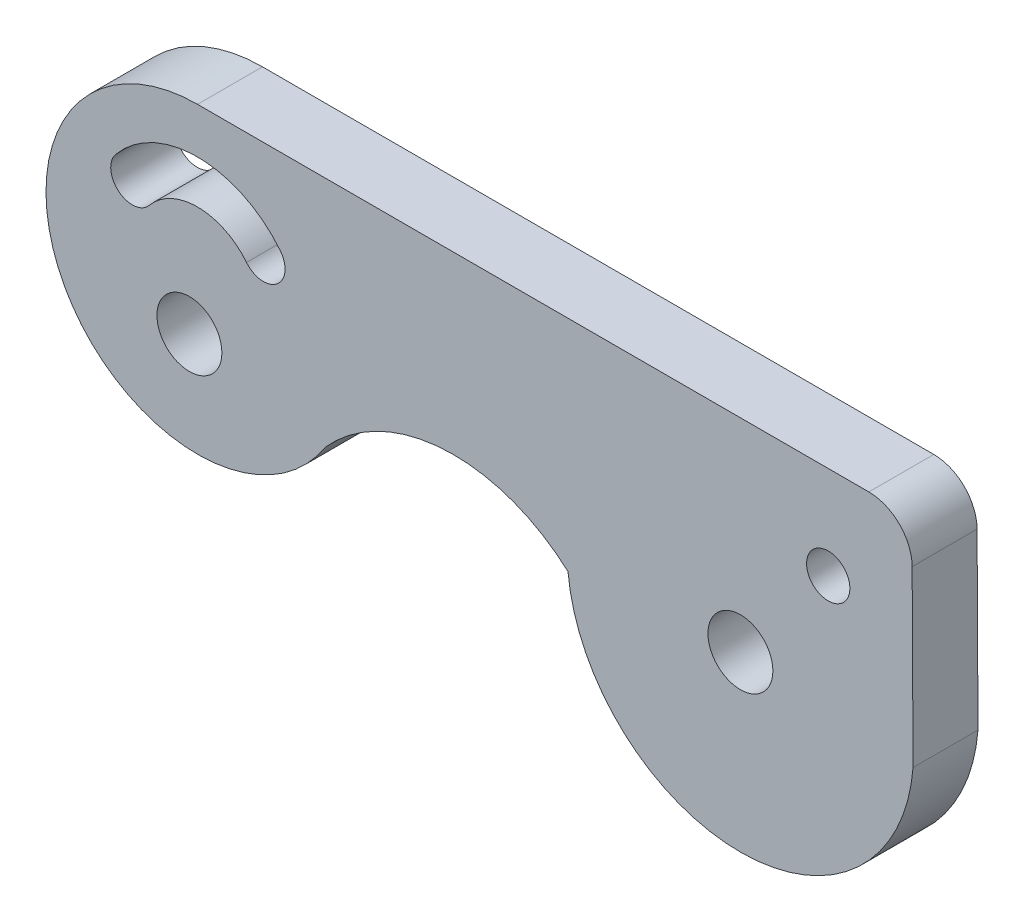
ISO-10303-21;
HEADER;
FILE_DESCRIPTION(('STEP AP214'),'2;1');
FILE_NAME('part.step','',(''),(''),'','','');
FILE_SCHEMA(('AUTOMOTIVE_DESIGN { 1 0 10303 214 1 1 1 1 }'));
ENDSEC;
DATA;
#1=APPLICATION_CONTEXT('core data for automotive mechanical design processes');
#2=APPLICATION_PROTOCOL_DEFINITION('international standard','automotive_design',2000,#1);
#3=PRODUCT_CONTEXT('',#1,'mechanical');
#4=PRODUCT('Part','Part','',(#3));
#5=PRODUCT_RELATED_PRODUCT_CATEGORY('part','',(#4));
#6=PRODUCT_DEFINITION_FORMATION('','',#4);
#7=PRODUCT_DEFINITION_CONTEXT('part definition',#1,'design');
#8=PRODUCT_DEFINITION('design','',#6,#7);
#9=PRODUCT_DEFINITION_SHAPE('','',#8);
#10=(LENGTH_UNIT() NAMED_UNIT(*) SI_UNIT(.MILLI.,.METRE.));
#11=(NAMED_UNIT(*) PLANE_ANGLE_UNIT() SI_UNIT($,.RADIAN.));
#12=(NAMED_UNIT(*) SI_UNIT($,.STERADIAN.) SOLID_ANGLE_UNIT());
#13=UNCERTAINTY_MEASURE_WITH_UNIT(LENGTH_MEASURE(1.E-05),#10,'distance_accuracy_value','');
#14=(GEOMETRIC_REPRESENTATION_CONTEXT(3) GLOBAL_UNCERTAINTY_ASSIGNED_CONTEXT((#13)) GLOBAL_UNIT_ASSIGNED_CONTEXT((#10,
#11,#12)) REPRESENTATION_CONTEXT('',''));
#15=CARTESIAN_POINT('',(0.,0.,0.));
#16=DIRECTION('',(0.,0.,1.));
#17=DIRECTION('',(1.,0.,0.));
#18=AXIS2_PLACEMENT_3D('',#15,#16,#17);
#19=CARTESIAN_POINT('',(0.,-7.,3.));
#20=DIRECTION('',(0.,0.,1.));
#21=DIRECTION('',(1.,0.,0.));
#22=AXIS2_PLACEMENT_3D('',#19,#20,#21);
#23=PLANE('',#22);
#24=CARTESIAN_POINT('',(29.1341202199942,-4.29894502293296,3.));
#25=DIRECTION('',(0.,0.,1.));
#26=DIRECTION('',(1.,0.,0.));
#27=AXIS2_PLACEMENT_3D('',#24,#25,#26);
#28=CIRCLE('',#27,1.);
#29=CARTESIAN_POINT('',(30.1341202199942,-4.29894502293296,3.));
#30=VERTEX_POINT('',#29);
#31=EDGE_CURVE('E142',#30,#30,#28,.T.);
#32=ORIENTED_EDGE('',*,*,#31,.F.);
#33=EDGE_LOOP('',(#32));
#34=FACE_BOUND('',#33,.T.);
#35=CARTESIAN_POINT('',(0.,-7.,3.));
#36=DIRECTION('',(0.,0.,1.));
#37=DIRECTION('',(1.,0.,0.));
#38=AXIS2_PLACEMENT_3D('',#35,#36,#37);
#39=CIRCLE('',#38,7.);
#40=CARTESIAN_POINT('',(0.,0.,3.));
#41=VERTEX_POINT('',#40);
#42=CARTESIAN_POINT('',(5.89507462855434,-10.7746649021834,3.));
#43=VERTEX_POINT('',#42);
#44=EDGE_CURVE('E158',#41,#43,#39,.T.);
#45=ORIENTED_EDGE('',*,*,#44,.T.);
#46=CARTESIAN_POINT('',(11.8200955665364,-16.,3.));
#47=DIRECTION('',(0.,0.,-1.));
#48=DIRECTION('',(-1.,0.,0.));
#49=AXIS2_PLACEMENT_3D('',#46,#47,#48);
#50=CIRCLE('',#49,7.9);
#51=CARTESIAN_POINT('',(17.1131167236741,-10.1353664197929,3.));
#52=VERTEX_POINT('',#51);
#53=EDGE_CURVE('E161',#43,#52,#50,.T.);
#54=ORIENTED_EDGE('',*,*,#53,.T.);
#55=CARTESIAN_POINT('',(25.0771298747732,-9.37741224629706,3.));
#56=DIRECTION('',(0.,0.,1.));
#57=DIRECTION('',(1.,0.,0.));
#58=AXIS2_PLACEMENT_3D('',#55,#56,#57);
#59=CIRCLE('',#58,8.);
#60=CARTESIAN_POINT('',(33.0525715786033,-10.0037744648319,3.));
#61=VERTEX_POINT('',#60);
#62=EDGE_CURVE('E164',#52,#61,#59,.T.);
#63=ORIENTED_EDGE('',*,*,#62,.T.);
#64=DIRECTION('',(-0.00525510174907032,0.999986191857471,0.));
#65=VECTOR('',#64,1.);
#66=CARTESIAN_POINT('',(33.0525715786033,-10.0037744648319,3.));
#67=LINE('',#66,#65);
#68=CARTESIAN_POINT('',(33.0104551156751,-1.98948979650187,3.));
#69=VERTEX_POINT('',#68);
#70=EDGE_CURVE('E166',#61,#69,#67,.T.);
#71=ORIENTED_EDGE('',*,*,#70,.T.);
#72=CARTESIAN_POINT('',(31.0104827319601,-2.,3.));
#73=DIRECTION('',(0.,0.,1.));
#74=DIRECTION('',(-1.,0.,0.));
#75=AXIS2_PLACEMENT_3D('',#72,#73,#74);
#76=CIRCLE('',#75,2.);
#77=CARTESIAN_POINT('',(31.0104827319601,0.,3.));
#78=VERTEX_POINT('',#77);
#79=EDGE_CURVE('E168',#69,#78,#76,.T.);
#80=ORIENTED_EDGE('',*,*,#79,.T.);
#81=DIRECTION('',(-1.,0.,0.));
#82=VECTOR('',#81,1.);
#83=CARTESIAN_POINT('',(0.,0.,3.));
#84=LINE('',#83,#82);
#85=EDGE_CURVE('E170',#78,#41,#84,.T.);
#86=ORIENTED_EDGE('',*,*,#85,.T.);
#87=EDGE_LOOP('',(#45,#54,#63,#71,#80,#86));
#88=FACE_BOUND('',#87,.T.);
#89=CARTESIAN_POINT('',(25.0771298747732,-9.37741224629706,3.));
#90=DIRECTION('',(0.,0.,1.));
#91=DIRECTION('',(1.,0.,0.));
#92=AXIS2_PLACEMENT_3D('',#89,#90,#91);
#93=CIRCLE('',#92,1.5);
#94=CARTESIAN_POINT('',(26.5771298747732,-9.37741224629706,3.));
#95=VERTEX_POINT('',#94);
#96=EDGE_CURVE('E152',#95,#95,#93,.T.);
#97=ORIENTED_EDGE('',*,*,#96,.F.);
#98=EDGE_LOOP('',(#97));
#99=FACE_BOUND('',#98,.T.);
#100=CARTESIAN_POINT('',(0.,-7.,3.));
#101=DIRECTION('',(0.,0.,1.));
#102=DIRECTION('',(1.,0.,0.));
#103=AXIS2_PLACEMENT_3D('',#100,#101,#102);
#104=CIRCLE('',#103,4.89513860802206);
#105=CARTESIAN_POINT('',(3.82509822416434,-3.9453305306068,3.));
#106=VERTEX_POINT('',#105);
#107=CARTESIAN_POINT('',(-3.78338685067451,-3.89381811062338,3.));
#108=VERTEX_POINT('',#107);
#109=EDGE_CURVE('E121',#106,#108,#104,.T.);
#110=ORIENTED_EDGE('',*,*,#109,.F.);
#111=CARTESIAN_POINT('',(3.04369068283428,-4.56935156739363,3.));
#112=DIRECTION('',(0.,0.,1.));
#113=DIRECTION('',(-1.,0.,0.));
#114=AXIS2_PLACEMENT_3D('',#111,#112,#113);
#115=CIRCLE('',#114,0.999999999999999);
#116=CARTESIAN_POINT('',(2.26228314150423,-5.19337260418047,3.));
#117=VERTEX_POINT('',#116);
#118=EDGE_CURVE('E113',#117,#106,#115,.T.);
#119=ORIENTED_EDGE('',*,*,#118,.F.);
#120=CARTESIAN_POINT('',(0.,-7.,3.));
#121=DIRECTION('',(0.,0.,-1.));
#122=DIRECTION('',(1.,0.,0.));
#123=AXIS2_PLACEMENT_3D('',#120,#121,#122);
#124=CIRCLE('',#123,2.89513860802206);
#125=CARTESIAN_POINT('',(-2.23761372609971,-5.16290654227117,3.));
#126=VERTEX_POINT('',#125);
#127=EDGE_CURVE('E136',#126,#117,#124,.T.);
#128=ORIENTED_EDGE('',*,*,#127,.F.);
#129=CARTESIAN_POINT('',(-3.01050028838711,-4.52836232644727,3.));
#130=DIRECTION('',(0.,0.,1.));
#131=DIRECTION('',(1.,0.,0.));
#132=AXIS2_PLACEMENT_3D('',#129,#130,#131);
#133=CIRCLE('',#132,1.);
#134=EDGE_CURVE('E134',#108,#126,#133,.T.);
#135=ORIENTED_EDGE('',*,*,#134,.F.);
#136=EDGE_LOOP('',(#110,#119,#128,#135));
#137=FACE_BOUND('',#136,.T.);
#138=CARTESIAN_POINT('',(-0.375746772067136,-9.37741224629706,3.));
#139=DIRECTION('',(0.,0.,1.));
#140=DIRECTION('',(1.,0.,0.));
#141=AXIS2_PLACEMENT_3D('',#138,#139,#140);
#142=CIRCLE('',#141,1.5);
#143=CARTESIAN_POINT('',(1.12425322793286,-9.37741224629706,3.));
#144=VERTEX_POINT('',#143);
#145=EDGE_CURVE('E270',#144,#144,#142,.T.);
#146=ORIENTED_EDGE('',*,*,#145,.F.);
#147=EDGE_LOOP('',(#146));
#148=FACE_BOUND('',#147,.T.);
#149=ADVANCED_FACE('F36',(#34,#88,#99,#137,#148),#23,.T.);
#150=CARTESIAN_POINT('',(0.,-7.,0.));
#151=DIRECTION('',(0.,0.,1.));
#152=DIRECTION('',(1.,0.,0.));
#153=AXIS2_PLACEMENT_3D('',#150,#151,#152);
#154=PLANE('',#153);
#155=CARTESIAN_POINT('',(25.0771298747732,-9.37741224629706,0.));
#156=DIRECTION('',(0.,0.,1.));
#157=DIRECTION('',(1.,0.,0.));
#158=AXIS2_PLACEMENT_3D('',#155,#156,#157);
#159=CIRCLE('',#158,1.5);
#160=CARTESIAN_POINT('',(26.5771298747732,-9.37741224629706,0.));
#161=VERTEX_POINT('',#160);
#162=EDGE_CURVE('E129',#161,#161,#159,.T.);
#163=ORIENTED_EDGE('',*,*,#162,.T.);
#164=EDGE_LOOP('',(#163));
#165=FACE_BOUND('',#164,.T.);
#166=CARTESIAN_POINT('',(0.,-7.,0.));
#167=DIRECTION('',(0.,0.,1.));
#168=DIRECTION('',(1.,0.,0.));
#169=AXIS2_PLACEMENT_3D('',#166,#167,#168);
#170=CIRCLE('',#169,7.);
#171=CARTESIAN_POINT('',(0.,0.,0.));
#172=VERTEX_POINT('',#171);
#173=CARTESIAN_POINT('',(5.89507462855434,-10.7746649021834,0.));
#174=VERTEX_POINT('',#173);
#175=EDGE_CURVE('E155',#172,#174,#170,.T.);
#176=ORIENTED_EDGE('',*,*,#175,.F.);
#177=DIRECTION('',(-1.,0.,0.));
#178=VECTOR('',#177,1.);
#179=CARTESIAN_POINT('',(0.,0.,0.));
#180=LINE('',#179,#178);
#181=CARTESIAN_POINT('',(31.0104827319601,0.,0.));
#182=VERTEX_POINT('',#181);
#183=EDGE_CURVE('E162',#182,#172,#180,.T.);
#184=ORIENTED_EDGE('',*,*,#183,.F.);
#185=CARTESIAN_POINT('',(31.0104827319601,-2.,0.));
#186=DIRECTION('',(0.,0.,1.));
#187=DIRECTION('',(-1.,0.,0.));
#188=AXIS2_PLACEMENT_3D('',#185,#186,#187);
#189=CIRCLE('',#188,2.);
#190=CARTESIAN_POINT('',(33.0104551156751,-1.98948979650187,0.));
#191=VERTEX_POINT('',#190);
#192=EDGE_CURVE('E181',#191,#182,#189,.T.);
#193=ORIENTED_EDGE('',*,*,#192,.F.);
#194=DIRECTION('',(-0.00525510174907032,0.999986191857471,0.));
#195=VECTOR('',#194,1.);
#196=CARTESIAN_POINT('',(33.0525715786033,-10.0037744648319,0.));
#197=LINE('',#196,#195);
#198=CARTESIAN_POINT('',(33.0525715786033,-10.0037744648319,0.));
#199=VERTEX_POINT('',#198);
#200=EDGE_CURVE('E179',#199,#191,#197,.T.);
#201=ORIENTED_EDGE('',*,*,#200,.F.);
#202=CARTESIAN_POINT('',(25.0771298747732,-9.37741224629706,0.));
#203=DIRECTION('',(0.,0.,1.));
#204=DIRECTION('',(1.,0.,0.));
#205=AXIS2_PLACEMENT_3D('',#202,#203,#204);
#206=CIRCLE('',#205,8.);
#207=CARTESIAN_POINT('',(17.1131167236741,-10.1353664197929,0.));
#208=VERTEX_POINT('',#207);
#209=EDGE_CURVE('E177',#208,#199,#206,.T.);
#210=ORIENTED_EDGE('',*,*,#209,.F.);
#211=CARTESIAN_POINT('',(11.8200955665364,-16.,0.));
#212=DIRECTION('',(0.,0.,-1.));
#213=DIRECTION('',(-1.,0.,0.));
#214=AXIS2_PLACEMENT_3D('',#211,#212,#213);
#215=CIRCLE('',#214,7.9);
#216=EDGE_CURVE('E175',#174,#208,#215,.T.);
#217=ORIENTED_EDGE('',*,*,#216,.F.);
#218=EDGE_LOOP('',(#176,#184,#193,#201,#210,#217));
#219=FACE_BOUND('',#218,.T.);
#220=CARTESIAN_POINT('',(3.04369068283428,-4.56935156739363,0.));
#221=DIRECTION('',(0.,0.,1.));
#222=DIRECTION('',(-1.,0.,0.));
#223=AXIS2_PLACEMENT_3D('',#220,#221,#222);
#224=CIRCLE('',#223,0.999999999999999);
#225=CARTESIAN_POINT('',(2.26228314150423,-5.19337260418047,0.));
#226=VERTEX_POINT('',#225);
#227=CARTESIAN_POINT('',(3.82509822416434,-3.9453305306068,0.));
#228=VERTEX_POINT('',#227);
#229=EDGE_CURVE('E59',#226,#228,#224,.T.);
#230=ORIENTED_EDGE('',*,*,#229,.T.);
#231=CARTESIAN_POINT('',(0.,-7.,0.));
#232=DIRECTION('',(0.,0.,1.));
#233=DIRECTION('',(1.,0.,0.));
#234=AXIS2_PLACEMENT_3D('',#231,#232,#233);
#235=CIRCLE('',#234,4.89513860802206);
#236=CARTESIAN_POINT('',(-3.78338685067451,-3.89381811062338,0.));
#237=VERTEX_POINT('',#236);
#238=EDGE_CURVE('E128',#228,#237,#235,.T.);
#239=ORIENTED_EDGE('',*,*,#238,.T.);
#240=CARTESIAN_POINT('',(-3.01050028838711,-4.52836232644727,0.));
#241=DIRECTION('',(0.,0.,1.));
#242=DIRECTION('',(1.,0.,0.));
#243=AXIS2_PLACEMENT_3D('',#240,#241,#242);
#244=CIRCLE('',#243,1.);
#245=CARTESIAN_POINT('',(-2.23761372609971,-5.16290654227117,0.));
#246=VERTEX_POINT('',#245);
#247=EDGE_CURVE('E144',#237,#246,#244,.T.);
#248=ORIENTED_EDGE('',*,*,#247,.T.);
#249=CARTESIAN_POINT('',(0.,-7.,0.));
#250=DIRECTION('',(0.,0.,-1.));
#251=DIRECTION('',(1.,0.,0.));
#252=AXIS2_PLACEMENT_3D('',#249,#250,#251);
#253=CIRCLE('',#252,2.89513860802206);
#254=EDGE_CURVE('E122',#246,#226,#253,.T.);
#255=ORIENTED_EDGE('',*,*,#254,.T.);
#256=EDGE_LOOP('',(#230,#239,#248,#255));
#257=FACE_BOUND('',#256,.T.);
#258=CARTESIAN_POINT('',(29.1341202199942,-4.29894502293296,0.));
#259=DIRECTION('',(0.,0.,1.));
#260=DIRECTION('',(1.,0.,0.));
#261=AXIS2_PLACEMENT_3D('',#258,#259,#260);
#262=CIRCLE('',#261,1.);
#263=CARTESIAN_POINT('',(30.1341202199942,-4.29894502293296,0.));
#264=VERTEX_POINT('',#263);
#265=EDGE_CURVE('E276',#264,#264,#262,.T.);
#266=ORIENTED_EDGE('',*,*,#265,.T.);
#267=EDGE_LOOP('',(#266));
#268=FACE_BOUND('',#267,.T.);
#269=CARTESIAN_POINT('',(-0.375746772067136,-9.37741224629706,0.));
#270=DIRECTION('',(0.,0.,1.));
#271=DIRECTION('',(1.,0.,0.));
#272=AXIS2_PLACEMENT_3D('',#269,#270,#271);
#273=CIRCLE('',#272,1.5);
#274=CARTESIAN_POINT('',(1.12425322793286,-9.37741224629706,0.));
#275=VERTEX_POINT('',#274);
#276=EDGE_CURVE('E273',#275,#275,#273,.T.);
#277=ORIENTED_EDGE('',*,*,#276,.T.);
#278=EDGE_LOOP('',(#277));
#279=FACE_BOUND('',#278,.T.);
#280=ADVANCED_FACE('F205',(#165,#219,#257,#268,#279),#154,.F.);
#281=CARTESIAN_POINT('',(0.,-7.,3.));
#282=DIRECTION('',(0.,0.,-1.));
#283=DIRECTION('',(-1.,0.,0.));
#284=AXIS2_PLACEMENT_3D('',#281,#282,#283);
#285=CYLINDRICAL_SURFACE('',#284,7.);
#286=ORIENTED_EDGE('',*,*,#175,.T.);
#287=DIRECTION('',(0.,0.,-1.));
#288=VECTOR('',#287,1.);
#289=CARTESIAN_POINT('',(5.89507462855434,-10.7746649021834,3.));
#290=LINE('',#289,#288);
#291=EDGE_CURVE('E11',#43,#174,#290,.T.);
#292=ORIENTED_EDGE('',*,*,#291,.F.);
#293=ORIENTED_EDGE('',*,*,#44,.F.);
#294=DIRECTION('',(0.,0.,-1.));
#295=VECTOR('',#294,1.);
#296=CARTESIAN_POINT('',(0.,0.,3.));
#297=LINE('',#296,#295);
#298=EDGE_CURVE('E172',#41,#172,#297,.T.);
#299=ORIENTED_EDGE('',*,*,#298,.T.);
#300=EDGE_LOOP('',(#286,#292,#293,#299));
#301=FACE_BOUND('',#300,.T.);
#302=ADVANCED_FACE('F38',(#301),#285,.T.);
#303=CARTESIAN_POINT('',(11.8200955665364,-16.,3.));
#304=DIRECTION('',(0.,0.,-1.));
#305=DIRECTION('',(-1.,0.,0.));
#306=AXIS2_PLACEMENT_3D('',#303,#304,#305);
#307=CYLINDRICAL_SURFACE('',#306,7.9);
#308=ORIENTED_EDGE('',*,*,#216,.T.);
#309=DIRECTION('',(0.,0.,-1.));
#310=VECTOR('',#309,1.);
#311=CARTESIAN_POINT('',(17.1131167236741,-10.1353664197929,3.));
#312=LINE('',#311,#310);
#313=EDGE_CURVE('E44',#52,#208,#312,.T.);
#314=ORIENTED_EDGE('',*,*,#313,.F.);
#315=ORIENTED_EDGE('',*,*,#53,.F.);
#316=ORIENTED_EDGE('',*,*,#291,.T.);
#317=EDGE_LOOP('',(#308,#314,#315,#316));
#318=FACE_BOUND('',#317,.T.);
#319=ADVANCED_FACE('F223',(#318),#307,.F.);
#320=CARTESIAN_POINT('',(25.0771298747732,-9.37741224629706,3.));
#321=DIRECTION('',(0.,0.,-1.));
#322=DIRECTION('',(-1.,0.,0.));
#323=AXIS2_PLACEMENT_3D('',#320,#321,#322);
#324=CYLINDRICAL_SURFACE('',#323,8.);
#325=ORIENTED_EDGE('',*,*,#209,.T.);
#326=DIRECTION('',(0.,0.,-1.));
#327=VECTOR('',#326,1.);
#328=CARTESIAN_POINT('',(33.0525715786033,-10.0037744648319,3.));
#329=LINE('',#328,#327);
#330=EDGE_CURVE('E192',#61,#199,#329,.T.);
#331=ORIENTED_EDGE('',*,*,#330,.F.);
#332=ORIENTED_EDGE('',*,*,#62,.F.);
#333=ORIENTED_EDGE('',*,*,#313,.T.);
#334=EDGE_LOOP('',(#325,#331,#332,#333));
#335=FACE_BOUND('',#334,.T.);
#336=ADVANCED_FACE('F199',(#335),#324,.T.);
#337=CARTESIAN_POINT('',(33.0525715786033,-10.0037744648319,3.));
#338=DIRECTION('',(-0.999986191857471,-0.00525510174907032,0.));
#339=DIRECTION('',(0.00525510174907032,-0.999986191857471,0.));
#340=AXIS2_PLACEMENT_3D('',#337,#338,#339);
#341=PLANE('',#340);
#342=ORIENTED_EDGE('',*,*,#200,.T.);
#343=DIRECTION('',(0.,0.,-1.));
#344=VECTOR('',#343,1.);
#345=CARTESIAN_POINT('',(33.0104551156751,-1.98948979650187,3.));
#346=LINE('',#345,#344);
#347=EDGE_CURVE('E189',#69,#191,#346,.T.);
#348=ORIENTED_EDGE('',*,*,#347,.F.);
#349=ORIENTED_EDGE('',*,*,#70,.F.);
#350=ORIENTED_EDGE('',*,*,#330,.T.);
#351=EDGE_LOOP('',(#342,#348,#349,#350));
#352=FACE_BOUND('',#351,.T.);
#353=ADVANCED_FACE('F211',(#352),#341,.F.);
#354=CARTESIAN_POINT('',(31.0104827319601,-2.,3.));
#355=DIRECTION('',(0.,0.,-1.));
#356=DIRECTION('',(-1.,0.,0.));
#357=AXIS2_PLACEMENT_3D('',#354,#355,#356);
#358=CYLINDRICAL_SURFACE('',#357,2.);
#359=ORIENTED_EDGE('',*,*,#192,.T.);
#360=DIRECTION('',(0.,0.,-1.));
#361=VECTOR('',#360,1.);
#362=CARTESIAN_POINT('',(31.0104827319601,0.,3.));
#363=LINE('',#362,#361);
#364=EDGE_CURVE('E186',#78,#182,#363,.T.);
#365=ORIENTED_EDGE('',*,*,#364,.F.);
#366=ORIENTED_EDGE('',*,*,#79,.F.);
#367=ORIENTED_EDGE('',*,*,#347,.T.);
#368=EDGE_LOOP('',(#359,#365,#366,#367));
#369=FACE_BOUND('',#368,.T.);
#370=ADVANCED_FACE('F215',(#369),#358,.T.);
#371=CARTESIAN_POINT('',(0.,0.,3.));
#372=DIRECTION('',(0.,-1.,0.));
#373=DIRECTION('',(0.,0.,-1.));
#374=AXIS2_PLACEMENT_3D('',#371,#372,#373);
#375=PLANE('',#374);
#376=ORIENTED_EDGE('',*,*,#183,.T.);
#377=ORIENTED_EDGE('',*,*,#298,.F.);
#378=ORIENTED_EDGE('',*,*,#85,.F.);
#379=ORIENTED_EDGE('',*,*,#364,.T.);
#380=EDGE_LOOP('',(#376,#377,#378,#379));
#381=FACE_BOUND('',#380,.T.);
#382=ADVANCED_FACE('F226',(#381),#375,.F.);
#383=CARTESIAN_POINT('',(25.0771298747732,-9.37741224629706,3.));
#384=DIRECTION('',(0.,0.,-1.));
#385=DIRECTION('',(-1.,0.,0.));
#386=AXIS2_PLACEMENT_3D('',#383,#384,#385);
#387=CYLINDRICAL_SURFACE('',#386,1.5);
#388=ORIENTED_EDGE('',*,*,#96,.T.);
#389=EDGE_LOOP('',(#388));
#390=FACE_BOUND('',#389,.T.);
#391=ORIENTED_EDGE('',*,*,#162,.F.);
#392=EDGE_LOOP('',(#391));
#393=FACE_BOUND('',#392,.T.);
#394=ADVANCED_FACE('F228',(#390,#393),#387,.F.);
#395=CARTESIAN_POINT('',(3.04369068283428,-4.56935156739363,3.));
#396=DIRECTION('',(0.,0.,-1.));
#397=DIRECTION('',(-1.,0.,0.));
#398=AXIS2_PLACEMENT_3D('',#395,#396,#397);
#399=CYLINDRICAL_SURFACE('',#398,0.999999999999999);
#400=ORIENTED_EDGE('',*,*,#229,.F.);
#401=DIRECTION('',(0.,0.,-1.));
#402=VECTOR('',#401,1.);
#403=CARTESIAN_POINT('',(2.26228314150423,-5.19337260418047,3.));
#404=LINE('',#403,#402);
#405=EDGE_CURVE('E117',#117,#226,#404,.T.);
#406=ORIENTED_EDGE('',*,*,#405,.F.);
#407=ORIENTED_EDGE('',*,*,#118,.T.);
#408=DIRECTION('',(0.,0.,-1.));
#409=VECTOR('',#408,1.);
#410=CARTESIAN_POINT('',(3.82509822416434,-3.9453305306068,3.));
#411=LINE('',#410,#409);
#412=EDGE_CURVE('E116',#106,#228,#411,.T.);
#413=ORIENTED_EDGE('',*,*,#412,.T.);
#414=EDGE_LOOP('',(#400,#406,#407,#413));
#415=FACE_BOUND('',#414,.T.);
#416=ADVANCED_FACE('F115',(#415),#399,.F.);
#417=CARTESIAN_POINT('',(0.,-7.,3.));
#418=DIRECTION('',(0.,0.,-1.));
#419=DIRECTION('',(-1.,0.,0.));
#420=AXIS2_PLACEMENT_3D('',#417,#418,#419);
#421=CYLINDRICAL_SURFACE('',#420,4.89513860802206);
#422=ORIENTED_EDGE('',*,*,#238,.F.);
#423=ORIENTED_EDGE('',*,*,#412,.F.);
#424=ORIENTED_EDGE('',*,*,#109,.T.);
#425=DIRECTION('',(0.,0.,-1.));
#426=VECTOR('',#425,1.);
#427=CARTESIAN_POINT('',(-3.78338685067451,-3.89381811062338,3.));
#428=LINE('',#427,#426);
#429=EDGE_CURVE('E130',#108,#237,#428,.T.);
#430=ORIENTED_EDGE('',*,*,#429,.T.);
#431=EDGE_LOOP('',(#422,#423,#424,#430));
#432=FACE_BOUND('',#431,.T.);
#433=ADVANCED_FACE('F125',(#432),#421,.F.);
#434=CARTESIAN_POINT('',(-3.01050028838711,-4.52836232644727,3.));
#435=DIRECTION('',(0.,0.,-1.));
#436=DIRECTION('',(-1.,0.,0.));
#437=AXIS2_PLACEMENT_3D('',#434,#435,#436);
#438=CYLINDRICAL_SURFACE('',#437,1.);
#439=ORIENTED_EDGE('',*,*,#247,.F.);
#440=ORIENTED_EDGE('',*,*,#429,.F.);
#441=ORIENTED_EDGE('',*,*,#134,.T.);
#442=DIRECTION('',(0.,0.,-1.));
#443=VECTOR('',#442,1.);
#444=CARTESIAN_POINT('',(-2.23761372609971,-5.16290654227117,3.));
#445=LINE('',#444,#443);
#446=EDGE_CURVE('E51',#126,#246,#445,.T.);
#447=ORIENTED_EDGE('',*,*,#446,.T.);
#448=EDGE_LOOP('',(#439,#440,#441,#447));
#449=FACE_BOUND('',#448,.T.);
#450=ADVANCED_FACE('F251',(#449),#438,.F.);
#451=CARTESIAN_POINT('',(0.,-7.,3.));
#452=DIRECTION('',(0.,0.,-1.));
#453=DIRECTION('',(-1.,0.,0.));
#454=AXIS2_PLACEMENT_3D('',#451,#452,#453);
#455=CYLINDRICAL_SURFACE('',#454,2.89513860802206);
#456=ORIENTED_EDGE('',*,*,#254,.F.);
#457=ORIENTED_EDGE('',*,*,#446,.F.);
#458=ORIENTED_EDGE('',*,*,#127,.T.);
#459=ORIENTED_EDGE('',*,*,#405,.T.);
#460=EDGE_LOOP('',(#456,#457,#458,#459));
#461=FACE_BOUND('',#460,.T.);
#462=ADVANCED_FACE('F254',(#461),#455,.T.);
#463=CARTESIAN_POINT('',(29.1341202199942,-4.29894502293296,3.));
#464=DIRECTION('',(0.,0.,-1.));
#465=DIRECTION('',(-1.,0.,0.));
#466=AXIS2_PLACEMENT_3D('',#463,#464,#465);
#467=CYLINDRICAL_SURFACE('',#466,1.);
#468=ORIENTED_EDGE('',*,*,#31,.T.);
#469=EDGE_LOOP('',(#468));
#470=FACE_BOUND('',#469,.T.);
#471=ORIENTED_EDGE('',*,*,#265,.F.);
#472=EDGE_LOOP('',(#471));
#473=FACE_BOUND('',#472,.T.);
#474=ADVANCED_FACE('F258',(#470,#473),#467,.F.);
#475=CARTESIAN_POINT('',(-0.375746772067136,-9.37741224629706,3.));
#476=DIRECTION('',(0.,0.,-1.));
#477=DIRECTION('',(-1.,0.,0.));
#478=AXIS2_PLACEMENT_3D('',#475,#476,#477);
#479=CYLINDRICAL_SURFACE('',#478,1.5);
#480=ORIENTED_EDGE('',*,*,#145,.T.);
#481=EDGE_LOOP('',(#480));
#482=FACE_BOUND('',#481,.T.);
#483=ORIENTED_EDGE('',*,*,#276,.F.);
#484=EDGE_LOOP('',(#483));
#485=FACE_BOUND('',#484,.T.);
#486=ADVANCED_FACE('F261',(#482,#485),#479,.F.);
#487=CLOSED_SHELL('',(#149,#280,#302,#319,#336,#353,#370,#382,#394,#416,#433,#450,#462,#474,#486));
#488=MANIFOLD_SOLID_BREP('B2',#487);
#489=ADVANCED_BREP_SHAPE_REPRESENTATION('',(#18,#488),#14);
#490=SHAPE_DEFINITION_REPRESENTATION(#9,#489);
ENDSEC;
END-ISO-10303-21;
